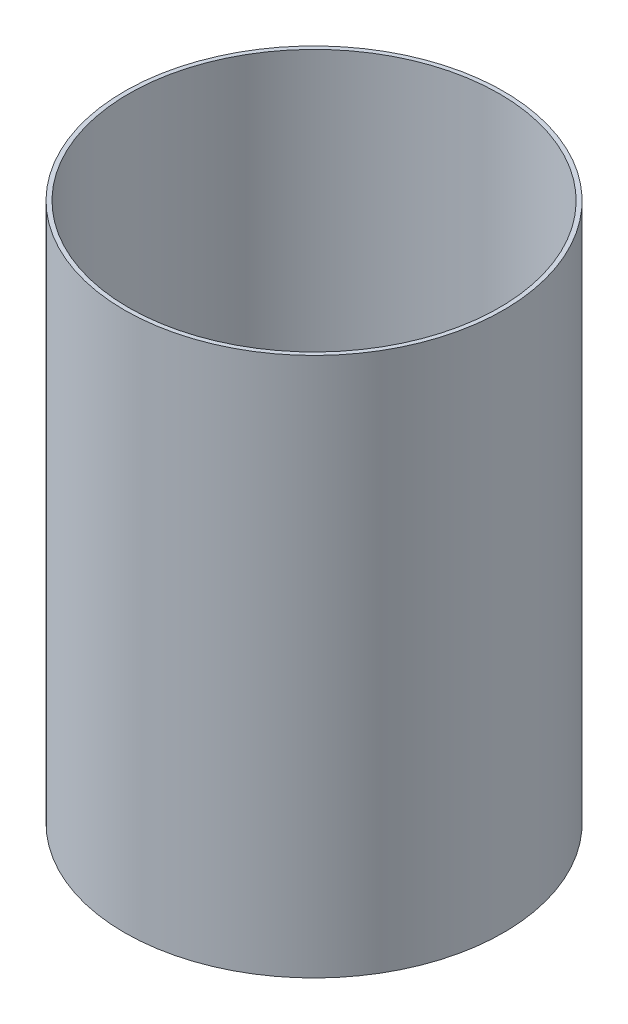
ISO-10303-21;
HEADER;
FILE_DESCRIPTION(('STEP AP214'),'2;1');
FILE_NAME('part.step','',(''),(''),'','','');
FILE_SCHEMA(('AUTOMOTIVE_DESIGN { 1 0 10303 214 1 1 1 1 }'));
ENDSEC;
DATA;
#1=APPLICATION_CONTEXT('core data for automotive mechanical design processes');
#2=APPLICATION_PROTOCOL_DEFINITION('international standard','automotive_design',2000,#1);
#3=PRODUCT_CONTEXT('',#1,'mechanical');
#4=PRODUCT('Part','Part','',(#3));
#5=PRODUCT_RELATED_PRODUCT_CATEGORY('part','',(#4));
#6=PRODUCT_DEFINITION_FORMATION('','',#4);
#7=PRODUCT_DEFINITION_CONTEXT('part definition',#1,'design');
#8=PRODUCT_DEFINITION('design','',#6,#7);
#9=PRODUCT_DEFINITION_SHAPE('','',#8);
#10=(LENGTH_UNIT() NAMED_UNIT(*) SI_UNIT(.MILLI.,.METRE.));
#11=(NAMED_UNIT(*) PLANE_ANGLE_UNIT() SI_UNIT($,.RADIAN.));
#12=(NAMED_UNIT(*) SI_UNIT($,.STERADIAN.) SOLID_ANGLE_UNIT());
#13=UNCERTAINTY_MEASURE_WITH_UNIT(LENGTH_MEASURE(1.E-05),#10,'distance_accuracy_value','');
#14=(GEOMETRIC_REPRESENTATION_CONTEXT(3) GLOBAL_UNCERTAINTY_ASSIGNED_CONTEXT((#13)) GLOBAL_UNIT_ASSIGNED_CONTEXT((#10,
#11,#12)) REPRESENTATION_CONTEXT('',''));
#15=CARTESIAN_POINT('',(0.,0.,0.));
#16=DIRECTION('',(0.,0.,1.));
#17=DIRECTION('',(1.,0.,0.));
#18=AXIS2_PLACEMENT_3D('',#15,#16,#17);
#19=CARTESIAN_POINT('',(0.,406.4,0.));
#20=DIRECTION('',(0.,1.,0.));
#21=DIRECTION('',(0.,0.,1.));
#22=AXIS2_PLACEMENT_3D('',#19,#20,#21);
#23=PLANE('',#22);
#24=CARTESIAN_POINT('',(0.,406.4,0.));
#25=DIRECTION('',(0.,1.,0.));
#26=DIRECTION('',(0.,0.,1.));
#27=AXIS2_PLACEMENT_3D('',#24,#25,#26);
#28=CIRCLE('',#27,142.875);
#29=CARTESIAN_POINT('',(0.,406.4,142.875));
#30=VERTEX_POINT('',#29);
#31=EDGE_CURVE('E10',#30,#30,#28,.T.);
#32=ORIENTED_EDGE('',*,*,#31,.T.);
#33=EDGE_LOOP('',(#32));
#34=FACE_BOUND('',#33,.T.);
#35=CARTESIAN_POINT('',(0.,406.4,0.));
#36=DIRECTION('',(0.,1.,0.));
#37=DIRECTION('',(0.,0.,1.));
#38=AXIS2_PLACEMENT_3D('',#35,#36,#37);
#39=CIRCLE('',#38,139.7);
#40=CARTESIAN_POINT('',(0.,406.4,139.7));
#41=VERTEX_POINT('',#40);
#42=EDGE_CURVE('E42',#41,#41,#39,.T.);
#43=ORIENTED_EDGE('',*,*,#42,.F.);
#44=EDGE_LOOP('',(#43));
#45=FACE_BOUND('',#44,.T.);
#46=ADVANCED_FACE('F31',(#34,#45),#23,.T.);
#47=CARTESIAN_POINT('',(0.,0.,0.));
#48=DIRECTION('',(0.,1.,0.));
#49=DIRECTION('',(0.,0.,1.));
#50=AXIS2_PLACEMENT_3D('',#47,#48,#49);
#51=PLANE('',#50);
#52=CARTESIAN_POINT('',(0.,0.,0.));
#53=DIRECTION('',(0.,1.,0.));
#54=DIRECTION('',(0.,0.,1.));
#55=AXIS2_PLACEMENT_3D('',#52,#53,#54);
#56=CIRCLE('',#55,142.875);
#57=CARTESIAN_POINT('',(0.,0.,142.875));
#58=VERTEX_POINT('',#57);
#59=EDGE_CURVE('E35',#58,#58,#56,.T.);
#60=ORIENTED_EDGE('',*,*,#59,.F.);
#61=EDGE_LOOP('',(#60));
#62=FACE_BOUND('',#61,.T.);
#63=CARTESIAN_POINT('',(0.,0.,0.));
#64=DIRECTION('',(0.,1.,0.));
#65=DIRECTION('',(0.,0.,1.));
#66=AXIS2_PLACEMENT_3D('',#63,#64,#65);
#67=CIRCLE('',#66,139.7);
#68=CARTESIAN_POINT('',(0.,0.,139.7));
#69=VERTEX_POINT('',#68);
#70=EDGE_CURVE('E44',#69,#69,#67,.T.);
#71=ORIENTED_EDGE('',*,*,#70,.T.);
#72=EDGE_LOOP('',(#71));
#73=FACE_BOUND('',#72,.T.);
#74=ADVANCED_FACE('F54',(#62,#73),#51,.F.);
#75=CARTESIAN_POINT('',(0.,406.4,0.));
#76=DIRECTION('',(0.,-1.,0.));
#77=DIRECTION('',(0.,0.,-1.));
#78=AXIS2_PLACEMENT_3D('',#75,#76,#77);
#79=CYLINDRICAL_SURFACE('',#78,142.875);
#80=ORIENTED_EDGE('',*,*,#31,.F.);
#81=EDGE_LOOP('',(#80));
#82=FACE_BOUND('',#81,.T.);
#83=ORIENTED_EDGE('',*,*,#59,.T.);
#84=EDGE_LOOP('',(#83));
#85=FACE_BOUND('',#84,.T.);
#86=ADVANCED_FACE('F33',(#82,#85),#79,.T.);
#87=CARTESIAN_POINT('',(0.,406.4,0.));
#88=DIRECTION('',(0.,-1.,0.));
#89=DIRECTION('',(0.,0.,-1.));
#90=AXIS2_PLACEMENT_3D('',#87,#88,#89);
#91=CYLINDRICAL_SURFACE('',#90,139.7);
#92=ORIENTED_EDGE('',*,*,#42,.T.);
#93=EDGE_LOOP('',(#92));
#94=FACE_BOUND('',#93,.T.);
#95=ORIENTED_EDGE('',*,*,#70,.F.);
#96=EDGE_LOOP('',(#95));
#97=FACE_BOUND('',#96,.T.);
#98=ADVANCED_FACE('F50',(#94,#97),#91,.F.);
#99=CLOSED_SHELL('',(#46,#74,#86,#98));
#100=MANIFOLD_SOLID_BREP('B2',#99);
#101=ADVANCED_BREP_SHAPE_REPRESENTATION('',(#18,#100),#14);
#102=SHAPE_DEFINITION_REPRESENTATION(#9,#101);
ENDSEC;
END-ISO-10303-21;
